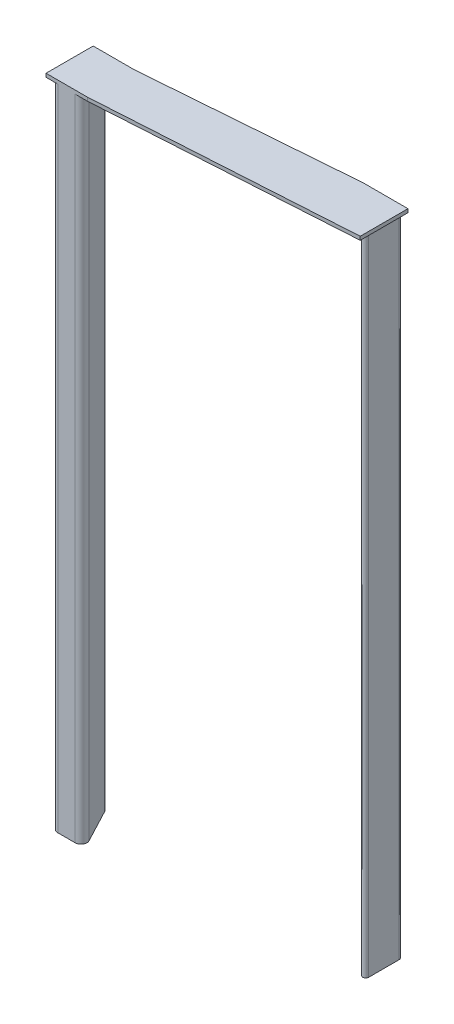
ISO-10303-21;
HEADER;
FILE_DESCRIPTION(('STEP AP214'),'2;1');
FILE_NAME('part.step','',(''),(''),'','','');
FILE_SCHEMA(('AUTOMOTIVE_DESIGN { 1 0 10303 214 1 1 1 1 }'));
ENDSEC;
DATA;
#1=APPLICATION_CONTEXT('core data for automotive mechanical design processes');
#2=APPLICATION_PROTOCOL_DEFINITION('international standard','automotive_design',2000,#1);
#3=PRODUCT_CONTEXT('',#1,'mechanical');
#4=PRODUCT('Part','Part','',(#3));
#5=PRODUCT_RELATED_PRODUCT_CATEGORY('part','',(#4));
#6=PRODUCT_DEFINITION_FORMATION('','',#4);
#7=PRODUCT_DEFINITION_CONTEXT('part definition',#1,'design');
#8=PRODUCT_DEFINITION('design','',#6,#7);
#9=PRODUCT_DEFINITION_SHAPE('','',#8);
#10=(LENGTH_UNIT() NAMED_UNIT(*) SI_UNIT(.MILLI.,.METRE.));
#11=(NAMED_UNIT(*) PLANE_ANGLE_UNIT() SI_UNIT($,.RADIAN.));
#12=(NAMED_UNIT(*) SI_UNIT($,.STERADIAN.) SOLID_ANGLE_UNIT());
#13=UNCERTAINTY_MEASURE_WITH_UNIT(LENGTH_MEASURE(1.E-05),#10,'distance_accuracy_value','');
#14=(GEOMETRIC_REPRESENTATION_CONTEXT(3) GLOBAL_UNCERTAINTY_ASSIGNED_CONTEXT((#13)) GLOBAL_UNIT_ASSIGNED_CONTEXT((#10,
#11,#12)) REPRESENTATION_CONTEXT('',''));
#15=CARTESIAN_POINT('',(0.,0.,0.));
#16=DIRECTION('',(0.,0.,1.));
#17=DIRECTION('',(1.,0.,0.));
#18=AXIS2_PLACEMENT_3D('',#15,#16,#17);
#19=CARTESIAN_POINT('',(97.2,238.085353189805,-7.4));
#20=DIRECTION('',(-0.785165755458099,0.,0.61928566627681));
#21=DIRECTION('',(0.61928566627681,0.,0.785165755458099));
#22=AXIS2_PLACEMENT_3D('',#19,#20,#21);
#23=PLANE('',#22);
#24=DIRECTION('',(-0.61928566627681,0.,-0.785165755458099));
#25=VECTOR('',#24,1.);
#26=CARTESIAN_POINT('',(97.2,0.,-7.4));
#27=LINE('',#26,#25);
#28=CARTESIAN_POINT('',(95.4148342445419,0.,-9.66333515424152));
#29=VERTEX_POINT('',#28);
#30=CARTESIAN_POINT('',(87.2771830607254,0.,-19.9807143337232));
#31=VERTEX_POINT('',#30);
#32=EDGE_CURVE('E158',#29,#31,#27,.T.);
#33=ORIENTED_EDGE('',*,*,#32,.F.);
#34=DIRECTION('',(0.,-1.,0.));
#35=VECTOR('',#34,1.);
#36=CARTESIAN_POINT('',(95.4148342445419,238.085353189805,-9.66333515424152));
#37=LINE('',#36,#35);
#38=CARTESIAN_POINT('',(95.4148342445419,220.,-9.66333515424152));
#39=VERTEX_POINT('',#38);
#40=EDGE_CURVE('E143',#29,#39,#37,.F.);
#41=ORIENTED_EDGE('',*,*,#40,.T.);
#42=DIRECTION('',(0.61928566627681,0.,0.785165755458099));
#43=VECTOR('',#42,1.);
#44=CARTESIAN_POINT('',(97.2,220.,-7.4));
#45=LINE('',#44,#43);
#46=CARTESIAN_POINT('',(87.2771830607254,220.,-19.9807143337232));
#47=VERTEX_POINT('',#46);
#48=EDGE_CURVE('E113',#47,#39,#45,.T.);
#49=ORIENTED_EDGE('',*,*,#48,.F.);
#50=DIRECTION('',(0.,-1.,0.));
#51=VECTOR('',#50,1.);
#52=CARTESIAN_POINT('',(87.2771830607254,238.085353189805,-19.9807143337232));
#53=LINE('',#52,#51);
#54=EDGE_CURVE('E140',#47,#31,#53,.T.);
#55=ORIENTED_EDGE('',*,*,#54,.T.);
#56=EDGE_LOOP('',(#33,#41,#49,#55));
#57=FACE_BOUND('',#56,.T.);
#58=ADVANCED_FACE('F55',(#57),#23,.T.);
#59=CARTESIAN_POINT('',(97.2,238.085353189805,-21.6));
#60=DIRECTION('',(1.,0.,0.));
#61=DIRECTION('',(0.,0.,-1.));
#62=AXIS2_PLACEMENT_3D('',#59,#60,#61);
#63=PLANE('',#62);
#64=DIRECTION('',(0.,0.,-1.));
#65=VECTOR('',#64,1.);
#66=CARTESIAN_POINT('',(97.2,220.,-21.6));
#67=LINE('',#66,#65);
#68=CARTESIAN_POINT('',(97.2,220.,-10.2826208205183));
#69=VERTEX_POINT('',#68);
#70=CARTESIAN_POINT('',(97.2,220.,-20.6));
#71=VERTEX_POINT('',#70);
#72=EDGE_CURVE('E111',#69,#71,#67,.T.);
#73=ORIENTED_EDGE('',*,*,#72,.F.);
#74=DIRECTION('',(0.,-1.,0.));
#75=VECTOR('',#74,1.);
#76=CARTESIAN_POINT('',(97.2,238.085353189805,-10.2826208205183));
#77=LINE('',#76,#75);
#78=CARTESIAN_POINT('',(97.2,0.,-10.2826208205183));
#79=VERTEX_POINT('',#78);
#80=EDGE_CURVE('E122',#69,#79,#77,.T.);
#81=ORIENTED_EDGE('',*,*,#80,.T.);
#82=DIRECTION('',(0.,0.,1.));
#83=VECTOR('',#82,1.);
#84=CARTESIAN_POINT('',(97.2,0.,-21.6));
#85=LINE('',#84,#83);
#86=CARTESIAN_POINT('',(97.2,0.,-20.6));
#87=VERTEX_POINT('',#86);
#88=EDGE_CURVE('E126',#87,#79,#85,.T.);
#89=ORIENTED_EDGE('',*,*,#88,.F.);
#90=DIRECTION('',(0.,-1.,0.));
#91=VECTOR('',#90,1.);
#92=CARTESIAN_POINT('',(97.2,238.085353189805,-20.6));
#93=LINE('',#92,#91);
#94=EDGE_CURVE('E125',#87,#71,#93,.F.);
#95=ORIENTED_EDGE('',*,*,#94,.T.);
#96=EDGE_LOOP('',(#73,#81,#89,#95));
#97=FACE_BOUND('',#96,.T.);
#98=ADVANCED_FACE('F120',(#97),#63,.T.);
#99=CARTESIAN_POINT('',(86.,238.085353189805,-21.6));
#100=DIRECTION('',(0.,0.,-1.));
#101=DIRECTION('',(-1.,0.,0.));
#102=AXIS2_PLACEMENT_3D('',#99,#100,#101);
#103=PLANE('',#102);
#104=DIRECTION('',(-1.,0.,0.));
#105=VECTOR('',#104,1.);
#106=CARTESIAN_POINT('',(86.,220.,-21.6));
#107=LINE('',#106,#105);
#108=CARTESIAN_POINT('',(96.2,220.,-21.6));
#109=VERTEX_POINT('',#108);
#110=CARTESIAN_POINT('',(88.0623488161835,220.,-21.6));
#111=VERTEX_POINT('',#110);
#112=EDGE_CURVE('E134',#109,#111,#107,.T.);
#113=ORIENTED_EDGE('',*,*,#112,.F.);
#114=DIRECTION('',(0.,-1.,0.));
#115=VECTOR('',#114,1.);
#116=CARTESIAN_POINT('',(96.2,238.085353189805,-21.6));
#117=LINE('',#116,#115);
#118=CARTESIAN_POINT('',(96.2,0.,-21.6));
#119=VERTEX_POINT('',#118);
#120=EDGE_CURVE('E12',#109,#119,#117,.T.);
#121=ORIENTED_EDGE('',*,*,#120,.T.);
#122=DIRECTION('',(1.,0.,0.));
#123=VECTOR('',#122,1.);
#124=CARTESIAN_POINT('',(86.,0.,-21.6));
#125=LINE('',#124,#123);
#126=CARTESIAN_POINT('',(88.0623488161835,0.,-21.6));
#127=VERTEX_POINT('',#126);
#128=EDGE_CURVE('E157',#127,#119,#125,.T.);
#129=ORIENTED_EDGE('',*,*,#128,.F.);
#130=DIRECTION('',(0.,-1.,0.));
#131=VECTOR('',#130,1.);
#132=CARTESIAN_POINT('',(88.0623488161835,238.085353189805,-21.6));
#133=LINE('',#132,#131);
#134=EDGE_CURVE('E63',#127,#111,#133,.F.);
#135=ORIENTED_EDGE('',*,*,#134,.T.);
#136=EDGE_LOOP('',(#113,#121,#129,#135));
#137=FACE_BOUND('',#136,.T.);
#138=ADVANCED_FACE('F159',(#137),#103,.T.);
#139=CARTESIAN_POINT('',(0.,0.,0.));
#140=DIRECTION('',(0.,-1.,0.));
#141=DIRECTION('',(0.,0.,-1.));
#142=AXIS2_PLACEMENT_3D('',#139,#140,#141);
#143=PLANE('',#142);
#144=CARTESIAN_POINT('',(93.6,0.,-18.));
#145=DIRECTION('',(0.,-1.,0.));
#146=DIRECTION('',(0.,0.,-1.));
#147=AXIS2_PLACEMENT_3D('',#144,#145,#146);
#148=CIRCLE('',#147,2.);
#149=CARTESIAN_POINT('',(93.6,0.,-20.));
#150=VERTEX_POINT('',#149);
#151=EDGE_CURVE('E163',#150,#150,#148,.T.);
#152=ORIENTED_EDGE('',*,*,#151,.F.);
#153=EDGE_LOOP('',(#152));
#154=FACE_BOUND('',#153,.T.);
#155=ORIENTED_EDGE('',*,*,#88,.T.);
#156=CARTESIAN_POINT('',(96.2,0.,-10.2826208205183));
#157=DIRECTION('',(0.,-1.,0.));
#158=DIRECTION('',(0.,0.,-1.));
#159=AXIS2_PLACEMENT_3D('',#156,#157,#158);
#160=CIRCLE('',#159,1.);
#161=EDGE_CURVE('E129',#79,#29,#160,.T.);
#162=ORIENTED_EDGE('',*,*,#161,.T.);
#163=ORIENTED_EDGE('',*,*,#32,.T.);
#164=CARTESIAN_POINT('',(88.0623488161835,0.,-20.6));
#165=DIRECTION('',(0.,-1.,0.));
#166=DIRECTION('',(0.,0.,-1.));
#167=AXIS2_PLACEMENT_3D('',#164,#165,#166);
#168=CIRCLE('',#167,1.);
#169=EDGE_CURVE('E130',#31,#127,#168,.T.);
#170=ORIENTED_EDGE('',*,*,#169,.T.);
#171=ORIENTED_EDGE('',*,*,#128,.T.);
#172=CARTESIAN_POINT('',(96.2,0.,-20.6));
#173=DIRECTION('',(0.,-1.,0.));
#174=DIRECTION('',(0.,0.,-1.));
#175=AXIS2_PLACEMENT_3D('',#172,#173,#174);
#176=CIRCLE('',#175,1.);
#177=EDGE_CURVE('E132',#119,#87,#176,.T.);
#178=ORIENTED_EDGE('',*,*,#177,.T.);
#179=EDGE_LOOP('',(#155,#162,#163,#170,#171,#178));
#180=FACE_BOUND('',#179,.T.);
#181=ADVANCED_FACE('F156',(#154,#180),#143,.T.);
#182=CARTESIAN_POINT('',(0.,220.,0.));
#183=DIRECTION('',(0.,-1.,0.));
#184=DIRECTION('',(0.,0.,-1.));
#185=AXIS2_PLACEMENT_3D('',#182,#183,#184);
#186=PLANE('',#185);
#187=ORIENTED_EDGE('',*,*,#48,.T.);
#188=CARTESIAN_POINT('',(96.2,220.,-10.2826208205183));
#189=DIRECTION('',(0.,-1.,0.));
#190=DIRECTION('',(0.,0.,-1.));
#191=AXIS2_PLACEMENT_3D('',#188,#189,#190);
#192=CIRCLE('',#191,1.);
#193=EDGE_CURVE('E108',#39,#69,#192,.F.);
#194=ORIENTED_EDGE('',*,*,#193,.T.);
#195=ORIENTED_EDGE('',*,*,#72,.T.);
#196=CARTESIAN_POINT('',(96.2,220.,-20.6));
#197=DIRECTION('',(0.,-1.,0.));
#198=DIRECTION('',(0.,0.,-1.));
#199=AXIS2_PLACEMENT_3D('',#196,#197,#198);
#200=CIRCLE('',#199,1.);
#201=EDGE_CURVE('E76',#71,#109,#200,.F.);
#202=ORIENTED_EDGE('',*,*,#201,.T.);
#203=ORIENTED_EDGE('',*,*,#112,.T.);
#204=CARTESIAN_POINT('',(88.0623488161835,220.,-20.6));
#205=DIRECTION('',(0.,-1.,0.));
#206=DIRECTION('',(0.,0.,-1.));
#207=AXIS2_PLACEMENT_3D('',#204,#205,#206);
#208=CIRCLE('',#207,1.);
#209=EDGE_CURVE('E145',#111,#47,#208,.F.);
#210=ORIENTED_EDGE('',*,*,#209,.T.);
#211=EDGE_LOOP('',(#187,#194,#195,#202,#203,#210));
#212=FACE_BOUND('',#211,.T.);
#213=ADVANCED_FACE('F110',(#212),#186,.F.);
#214=CARTESIAN_POINT('',(93.6,5.,-18.));
#215=DIRECTION('',(0.,-1.,0.));
#216=DIRECTION('',(0.,0.,-1.));
#217=AXIS2_PLACEMENT_3D('',#214,#215,#216);
#218=CYLINDRICAL_SURFACE('',#217,2.);
#219=CARTESIAN_POINT('',(93.6,5.,-18.));
#220=DIRECTION('',(0.,-1.,0.));
#221=DIRECTION('',(0.,0.,-1.));
#222=AXIS2_PLACEMENT_3D('',#219,#220,#221);
#223=CIRCLE('',#222,2.);
#224=CARTESIAN_POINT('',(93.6,5.,-20.));
#225=VERTEX_POINT('',#224);
#226=EDGE_CURVE('E166',#225,#225,#223,.T.);
#227=ORIENTED_EDGE('',*,*,#226,.F.);
#228=EDGE_LOOP('',(#227));
#229=FACE_BOUND('',#228,.T.);
#230=ORIENTED_EDGE('',*,*,#151,.T.);
#231=EDGE_LOOP('',(#230));
#232=FACE_BOUND('',#231,.T.);
#233=ADVANCED_FACE('F172',(#229,#232),#218,.F.);
#234=CARTESIAN_POINT('',(93.6,5.,-18.));
#235=DIRECTION('',(0.,-1.,0.));
#236=DIRECTION('',(0.,0.,-1.));
#237=AXIS2_PLACEMENT_3D('',#234,#235,#236);
#238=PLANE('',#237);
#239=ORIENTED_EDGE('',*,*,#226,.T.);
#240=EDGE_LOOP('',(#239));
#241=FACE_BOUND('',#240,.T.);
#242=ADVANCED_FACE('F192',(#241),#238,.T.);
#243=CARTESIAN_POINT('',(96.2,238.085353189805,-10.2826208205183));
#244=DIRECTION('',(0.,-1.,0.));
#245=DIRECTION('',(0.,0.,-1.));
#246=AXIS2_PLACEMENT_3D('',#243,#244,#245);
#247=CYLINDRICAL_SURFACE('',#246,1.);
#248=ORIENTED_EDGE('',*,*,#193,.F.);
#249=ORIENTED_EDGE('',*,*,#40,.F.);
#250=ORIENTED_EDGE('',*,*,#161,.F.);
#251=ORIENTED_EDGE('',*,*,#80,.F.);
#252=EDGE_LOOP('',(#248,#249,#250,#251));
#253=FACE_BOUND('',#252,.T.);
#254=ADVANCED_FACE('F128',(#253),#247,.T.);
#255=CARTESIAN_POINT('',(96.2,238.085353189805,-20.6));
#256=DIRECTION('',(0.,-1.,0.));
#257=DIRECTION('',(0.,0.,-1.));
#258=AXIS2_PLACEMENT_3D('',#255,#256,#257);
#259=CYLINDRICAL_SURFACE('',#258,1.);
#260=ORIENTED_EDGE('',*,*,#201,.F.);
#261=ORIENTED_EDGE('',*,*,#94,.F.);
#262=ORIENTED_EDGE('',*,*,#177,.F.);
#263=ORIENTED_EDGE('',*,*,#120,.F.);
#264=EDGE_LOOP('',(#260,#261,#262,#263));
#265=FACE_BOUND('',#264,.T.);
#266=ADVANCED_FACE('F191',(#265),#259,.T.);
#267=CARTESIAN_POINT('',(88.0623488161835,238.085353189805,-20.6));
#268=DIRECTION('',(0.,-1.,0.));
#269=DIRECTION('',(0.,0.,-1.));
#270=AXIS2_PLACEMENT_3D('',#267,#268,#269);
#271=CYLINDRICAL_SURFACE('',#270,1.);
#272=ORIENTED_EDGE('',*,*,#209,.F.);
#273=ORIENTED_EDGE('',*,*,#134,.F.);
#274=ORIENTED_EDGE('',*,*,#169,.F.);
#275=ORIENTED_EDGE('',*,*,#54,.F.);
#276=EDGE_LOOP('',(#272,#273,#274,#275));
#277=FACE_BOUND('',#276,.T.);
#278=ADVANCED_FACE('F57',(#277),#271,.T.);
#279=CLOSED_SHELL('',(#58,#98,#138,#181,#213,#233,#242,#254,#266,#278));
#280=MANIFOLD_SOLID_BREP('B2',#279);
#281=CARTESIAN_POINT('',(11.2,220.,0.));
#282=DIRECTION('',(0.,0.,-1.));
#283=DIRECTION('',(-1.,0.,0.));
#284=AXIS2_PLACEMENT_3D('',#281,#282,#283);
#285=PLANE('',#284);
#286=DIRECTION('',(1.,0.,0.));
#287=VECTOR('',#286,1.);
#288=CARTESIAN_POINT('',(11.2,0.,0.));
#289=LINE('',#288,#287);
#290=CARTESIAN_POINT('',(2.,0.,0.));
#291=VERTEX_POINT('',#290);
#292=CARTESIAN_POINT('',(7.881447611978,0.,0.));
#293=VERTEX_POINT('',#292);
#294=EDGE_CURVE('E461',#291,#293,#289,.T.);
#295=ORIENTED_EDGE('',*,*,#294,.T.);
#296=DIRECTION('',(0.,-1.,0.));
#297=VECTOR('',#296,1.);
#298=CARTESIAN_POINT('',(7.881447611978,220.,0.));
#299=LINE('',#298,#297);
#300=CARTESIAN_POINT('',(7.881447611978,220.,0.));
#301=VERTEX_POINT('',#300);
#302=EDGE_CURVE('E53',#293,#301,#299,.F.);
#303=ORIENTED_EDGE('',*,*,#302,.T.);
#304=DIRECTION('',(1.,0.,0.));
#305=VECTOR('',#304,1.);
#306=CARTESIAN_POINT('',(12.,220.,0.));
#307=LINE('',#306,#305);
#308=CARTESIAN_POINT('',(12.,220.,0.));
#309=VERTEX_POINT('',#308);
#310=EDGE_CURVE('E541',#301,#309,#307,.T.);
#311=ORIENTED_EDGE('',*,*,#310,.T.);
#312=DIRECTION('',(0.,-1.,0.));
#313=VECTOR('',#312,1.);
#314=CARTESIAN_POINT('',(12.,221.2,0.));
#315=LINE('',#314,#313);
#316=CARTESIAN_POINT('',(12.,221.2,0.));
#317=VERTEX_POINT('',#316);
#318=EDGE_CURVE('E558',#317,#309,#315,.T.);
#319=ORIENTED_EDGE('',*,*,#318,.F.);
#320=DIRECTION('',(1.,0.,0.));
#321=VECTOR('',#320,1.);
#322=CARTESIAN_POINT('',(12.,221.2,0.));
#323=LINE('',#322,#321);
#324=CARTESIAN_POINT('',(-2.,221.2,0.));
#325=VERTEX_POINT('',#324);
#326=EDGE_CURVE('E591',#325,#317,#323,.T.);
#327=ORIENTED_EDGE('',*,*,#326,.F.);
#328=DIRECTION('',(0.,-1.,0.));
#329=VECTOR('',#328,1.);
#330=CARTESIAN_POINT('',(-2.,221.2,0.));
#331=LINE('',#330,#329);
#332=CARTESIAN_POINT('',(-2.,220.,0.));
#333=VERTEX_POINT('',#332);
#334=EDGE_CURVE('E561',#325,#333,#331,.T.);
#335=ORIENTED_EDGE('',*,*,#334,.T.);
#336=CARTESIAN_POINT('',(2.,220.,0.));
#337=VERTEX_POINT('',#336);
#338=EDGE_CURVE('E523',#333,#337,#307,.T.);
#339=ORIENTED_EDGE('',*,*,#338,.T.);
#340=DIRECTION('',(0.,-1.,0.));
#341=VECTOR('',#340,1.);
#342=CARTESIAN_POINT('',(2.,220.,0.));
#343=LINE('',#342,#341);
#344=EDGE_CURVE('E270',#337,#291,#343,.T.);
#345=ORIENTED_EDGE('',*,*,#344,.T.);
#346=EDGE_LOOP('',(#295,#303,#311,#319,#327,#335,#339,#345));
#347=FACE_BOUND('',#346,.T.);
#348=ADVANCED_FACE('F261',(#347),#285,.F.);
#349=CARTESIAN_POINT('',(0.,220.,-21.2));
#350=DIRECTION('',(-0.884193384073724,0.,0.467121033095552));
#351=DIRECTION('',(0.467121033095552,0.,0.884193384073724));
#352=AXIS2_PLACEMENT_3D('',#349,#350,#351);
#353=PLANE('',#352);
#354=DIRECTION('',(-0.467121033095552,0.,-0.884193384073724));
#355=VECTOR('',#354,1.);
#356=CARTESIAN_POINT('',(0.,0.,-21.2));
#357=LINE('',#356,#355);
#358=CARTESIAN_POINT('',(9.64983438012545,0.,-2.93424206619111));
#359=VERTEX_POINT('',#358);
#360=CARTESIAN_POINT('',(3.76838676814745,0.,-14.0669821888638));
#361=VERTEX_POINT('',#360);
#362=EDGE_CURVE('E477',#359,#361,#357,.T.);
#363=ORIENTED_EDGE('',*,*,#362,.T.);
#364=DIRECTION('',(0.,-1.,0.));
#365=VECTOR('',#364,1.);
#366=CARTESIAN_POINT('',(3.76838676814745,220.,-14.0669821888638));
#367=LINE('',#366,#365);
#368=CARTESIAN_POINT('',(3.76838676814745,220.,-14.0669821888638));
#369=VERTEX_POINT('',#368);
#370=EDGE_CURVE('E503',#361,#369,#367,.F.);
#371=ORIENTED_EDGE('',*,*,#370,.T.);
#372=DIRECTION('',(-0.467121033095552,0.,-0.884193384073724));
#373=VECTOR('',#372,1.);
#374=CARTESIAN_POINT('',(0.,220.,-21.2));
#375=LINE('',#374,#373);
#376=CARTESIAN_POINT('',(9.64983438012545,220.,-2.93424206619111));
#377=VERTEX_POINT('',#376);
#378=EDGE_CURVE('E465',#377,#369,#375,.T.);
#379=ORIENTED_EDGE('',*,*,#378,.F.);
#380=DIRECTION('',(0.,-1.,0.));
#381=VECTOR('',#380,1.);
#382=CARTESIAN_POINT('',(9.64983438012545,220.,-2.93424206619111));
#383=LINE('',#382,#381);
#384=EDGE_CURVE('E499',#377,#359,#383,.T.);
#385=ORIENTED_EDGE('',*,*,#384,.T.);
#386=EDGE_LOOP('',(#363,#371,#379,#385));
#387=FACE_BOUND('',#386,.T.);
#388=ADVANCED_FACE('F534',(#387),#353,.F.);
#389=CARTESIAN_POINT('',(0.,220.,0.));
#390=DIRECTION('',(1.,0.,0.));
#391=DIRECTION('',(0.,0.,-1.));
#392=AXIS2_PLACEMENT_3D('',#389,#390,#391);
#393=PLANE('',#392);
#394=DIRECTION('',(0.,0.,1.));
#395=VECTOR('',#394,1.);
#396=CARTESIAN_POINT('',(0.,220.,0.));
#397=LINE('',#396,#395);
#398=CARTESIAN_POINT('',(0.,220.,-13.1327401226727));
#399=VERTEX_POINT('',#398);
#400=CARTESIAN_POINT('',(0.,220.,-2.));
#401=VERTEX_POINT('',#400);
#402=EDGE_CURVE('E469',#399,#401,#397,.T.);
#403=ORIENTED_EDGE('',*,*,#402,.F.);
#404=DIRECTION('',(0.,-1.,0.));
#405=VECTOR('',#404,1.);
#406=CARTESIAN_POINT('',(0.,220.,-13.1327401226727));
#407=LINE('',#406,#405);
#408=CARTESIAN_POINT('',(0.,0.,-13.1327401226727));
#409=VERTEX_POINT('',#408);
#410=EDGE_CURVE('E486',#399,#409,#407,.T.);
#411=ORIENTED_EDGE('',*,*,#410,.T.);
#412=DIRECTION('',(0.,0.,1.));
#413=VECTOR('',#412,1.);
#414=CARTESIAN_POINT('',(0.,0.,0.));
#415=LINE('',#414,#413);
#416=CARTESIAN_POINT('',(0.,0.,-2.));
#417=VERTEX_POINT('',#416);
#418=EDGE_CURVE('E470',#409,#417,#415,.T.);
#419=ORIENTED_EDGE('',*,*,#418,.T.);
#420=DIRECTION('',(0.,-1.,0.));
#421=VECTOR('',#420,1.);
#422=CARTESIAN_POINT('',(0.,220.,-2.));
#423=LINE('',#422,#421);
#424=EDGE_CURVE('E474',#417,#401,#423,.F.);
#425=ORIENTED_EDGE('',*,*,#424,.T.);
#426=EDGE_LOOP('',(#403,#411,#419,#425));
#427=FACE_BOUND('',#426,.T.);
#428=ADVANCED_FACE('F616',(#427),#393,.F.);
#429=CARTESIAN_POINT('',(0.,0.,0.));
#430=DIRECTION('',(0.,-1.,0.));
#431=DIRECTION('',(0.,0.,-1.));
#432=AXIS2_PLACEMENT_3D('',#429,#430,#431);
#433=PLANE('',#432);
#434=DIRECTION('',(0.,0.,-1.));
#435=VECTOR('',#434,1.);
#436=CARTESIAN_POINT('',(2.,0.,-7.2));
#437=LINE('',#436,#435);
#438=CARTESIAN_POINT('',(2.,0.,-7.2));
#439=VERTEX_POINT('',#438);
#440=CARTESIAN_POINT('',(2.,0.,-9.6));
#441=VERTEX_POINT('',#440);
#442=EDGE_CURVE('E277',#439,#441,#437,.T.);
#443=ORIENTED_EDGE('',*,*,#442,.F.);
#444=DIRECTION('',(-1.,0.,0.));
#445=VECTOR('',#444,1.);
#446=CARTESIAN_POINT('',(2.,0.,-7.2));
#447=LINE('',#446,#445);
#448=CARTESIAN_POINT('',(4.4,0.,-7.2));
#449=VERTEX_POINT('',#448);
#450=EDGE_CURVE('E422',#449,#439,#447,.T.);
#451=ORIENTED_EDGE('',*,*,#450,.F.);
#452=DIRECTION('',(0.,0.,1.));
#453=VECTOR('',#452,1.);
#454=CARTESIAN_POINT('',(4.4,0.,-7.2));
#455=LINE('',#454,#453);
#456=CARTESIAN_POINT('',(4.4,0.,-9.6));
#457=VERTEX_POINT('',#456);
#458=EDGE_CURVE('E438',#457,#449,#455,.T.);
#459=ORIENTED_EDGE('',*,*,#458,.F.);
#460=DIRECTION('',(1.,0.,0.));
#461=VECTOR('',#460,1.);
#462=CARTESIAN_POINT('',(2.,0.,-9.6));
#463=LINE('',#462,#461);
#464=EDGE_CURVE('E411',#441,#457,#463,.T.);
#465=ORIENTED_EDGE('',*,*,#464,.F.);
#466=EDGE_LOOP('',(#443,#451,#459,#465));
#467=FACE_BOUND('',#466,.T.);
#468=CARTESIAN_POINT('',(4.,0.,-4.));
#469=DIRECTION('',(0.,-1.,0.));
#470=DIRECTION('',(0.,0.,-1.));
#471=AXIS2_PLACEMENT_3D('',#468,#469,#470);
#472=CIRCLE('',#471,2.);
#473=CARTESIAN_POINT('',(4.,0.,-6.));
#474=VERTEX_POINT('',#473);
#475=EDGE_CURVE('E448',#474,#474,#472,.T.);
#476=ORIENTED_EDGE('',*,*,#475,.F.);
#477=EDGE_LOOP('',(#476));
#478=FACE_BOUND('',#477,.T.);
#479=ORIENTED_EDGE('',*,*,#418,.F.);
#480=CARTESIAN_POINT('',(2.,0.,-13.1327401226727));
#481=DIRECTION('',(0.,-1.,0.));
#482=DIRECTION('',(0.,0.,-1.));
#483=AXIS2_PLACEMENT_3D('',#480,#481,#482);
#484=CIRCLE('',#483,2.);
#485=EDGE_CURVE('E496',#409,#361,#484,.T.);
#486=ORIENTED_EDGE('',*,*,#485,.T.);
#487=ORIENTED_EDGE('',*,*,#362,.F.);
#488=CARTESIAN_POINT('',(7.881447611978,0.,-2.));
#489=DIRECTION('',(0.,-1.,0.));
#490=DIRECTION('',(0.,0.,-1.));
#491=AXIS2_PLACEMENT_3D('',#488,#489,#490);
#492=CIRCLE('',#491,2.);
#493=EDGE_CURVE('E493',#359,#293,#492,.T.);
#494=ORIENTED_EDGE('',*,*,#493,.T.);
#495=ORIENTED_EDGE('',*,*,#294,.F.);
#496=CARTESIAN_POINT('',(2.,0.,-2.));
#497=DIRECTION('',(0.,-1.,0.));
#498=DIRECTION('',(0.,0.,-1.));
#499=AXIS2_PLACEMENT_3D('',#496,#497,#498);
#500=CIRCLE('',#499,2.);
#501=EDGE_CURVE('E490',#291,#417,#500,.T.);
#502=ORIENTED_EDGE('',*,*,#501,.T.);
#503=EDGE_LOOP('',(#479,#486,#487,#494,#495,#502));
#504=FACE_BOUND('',#503,.T.);
#505=ADVANCED_FACE('F528',(#467,#478,#504),#433,.T.);
#506=CARTESIAN_POINT('',(2.,220.,-13.1327401226727));
#507=DIRECTION('',(0.,-1.,0.));
#508=DIRECTION('',(0.,0.,-1.));
#509=AXIS2_PLACEMENT_3D('',#506,#507,#508);
#510=CYLINDRICAL_SURFACE('',#509,2.);
#511=CARTESIAN_POINT('',(2.,220.,-13.1327401226727));
#512=DIRECTION('',(0.,-1.,0.));
#513=DIRECTION('',(0.,0.,-1.));
#514=AXIS2_PLACEMENT_3D('',#511,#512,#513);
#515=CIRCLE('',#514,2.);
#516=EDGE_CURVE('E514',#369,#399,#515,.F.);
#517=ORIENTED_EDGE('',*,*,#516,.F.);
#518=ORIENTED_EDGE('',*,*,#370,.F.);
#519=ORIENTED_EDGE('',*,*,#485,.F.);
#520=ORIENTED_EDGE('',*,*,#410,.F.);
#521=EDGE_LOOP('',(#517,#518,#519,#520));
#522=FACE_BOUND('',#521,.T.);
#523=ADVANCED_FACE('F620',(#522),#510,.T.);
#524=CARTESIAN_POINT('',(7.881447611978,220.,-2.));
#525=DIRECTION('',(0.,-1.,0.));
#526=DIRECTION('',(0.,0.,-1.));
#527=AXIS2_PLACEMENT_3D('',#524,#525,#526);
#528=CYLINDRICAL_SURFACE('',#527,2.);
#529=CARTESIAN_POINT('',(7.881447611978,220.,-2.));
#530=DIRECTION('',(0.,-1.,0.));
#531=DIRECTION('',(0.,0.,-1.));
#532=AXIS2_PLACEMENT_3D('',#529,#530,#531);
#533=CIRCLE('',#532,2.);
#534=EDGE_CURVE('E510',#301,#377,#533,.F.);
#535=ORIENTED_EDGE('',*,*,#534,.F.);
#536=ORIENTED_EDGE('',*,*,#302,.F.);
#537=ORIENTED_EDGE('',*,*,#493,.F.);
#538=ORIENTED_EDGE('',*,*,#384,.F.);
#539=EDGE_LOOP('',(#535,#536,#537,#538));
#540=FACE_BOUND('',#539,.T.);
#541=ADVANCED_FACE('F531',(#540),#528,.T.);
#542=CARTESIAN_POINT('',(2.,220.,-2.));
#543=DIRECTION('',(0.,-1.,0.));
#544=DIRECTION('',(0.,0.,-1.));
#545=AXIS2_PLACEMENT_3D('',#542,#543,#544);
#546=CYLINDRICAL_SURFACE('',#545,2.);
#547=CARTESIAN_POINT('',(2.,220.,-2.));
#548=DIRECTION('',(0.,-1.,0.));
#549=DIRECTION('',(0.,0.,-1.));
#550=AXIS2_PLACEMENT_3D('',#547,#548,#549);
#551=CIRCLE('',#550,2.);
#552=EDGE_CURVE('E506',#401,#337,#551,.F.);
#553=ORIENTED_EDGE('',*,*,#552,.F.);
#554=ORIENTED_EDGE('',*,*,#424,.F.);
#555=ORIENTED_EDGE('',*,*,#501,.F.);
#556=ORIENTED_EDGE('',*,*,#344,.F.);
#557=EDGE_LOOP('',(#553,#554,#555,#556));
#558=FACE_BOUND('',#557,.T.);
#559=ADVANCED_FACE('F263',(#558),#546,.T.);
#560=CARTESIAN_POINT('',(4.,5.,-4.));
#561=DIRECTION('',(0.,-1.,0.));
#562=DIRECTION('',(0.,0.,-1.));
#563=AXIS2_PLACEMENT_3D('',#560,#561,#562);
#564=CYLINDRICAL_SURFACE('',#563,2.);
#565=CARTESIAN_POINT('',(4.,5.,-4.));
#566=DIRECTION('',(0.,-1.,0.));
#567=DIRECTION('',(0.,0.,-1.));
#568=AXIS2_PLACEMENT_3D('',#565,#566,#567);
#569=CIRCLE('',#568,2.);
#570=CARTESIAN_POINT('',(4.,5.,-6.));
#571=VERTEX_POINT('',#570);
#572=EDGE_CURVE('E457',#571,#571,#569,.T.);
#573=ORIENTED_EDGE('',*,*,#572,.F.);
#574=EDGE_LOOP('',(#573));
#575=FACE_BOUND('',#574,.T.);
#576=ORIENTED_EDGE('',*,*,#475,.T.);
#577=EDGE_LOOP('',(#576));
#578=FACE_BOUND('',#577,.T.);
#579=ADVANCED_FACE('F627',(#575,#578),#564,.F.);
#580=CARTESIAN_POINT('',(4.,5.,-4.));
#581=DIRECTION('',(0.,-1.,0.));
#582=DIRECTION('',(0.,0.,-1.));
#583=AXIS2_PLACEMENT_3D('',#580,#581,#582);
#584=PLANE('',#583);
#585=ORIENTED_EDGE('',*,*,#572,.T.);
#586=EDGE_LOOP('',(#585));
#587=FACE_BOUND('',#586,.T.);
#588=ADVANCED_FACE('F632',(#587),#584,.T.);
#589=CARTESIAN_POINT('',(2.,2.,-7.2));
#590=DIRECTION('',(-1.,0.,0.));
#591=DIRECTION('',(0.,0.,1.));
#592=AXIS2_PLACEMENT_3D('',#589,#590,#591);
#593=PLANE('',#592);
#594=ORIENTED_EDGE('',*,*,#442,.T.);
#595=DIRECTION('',(0.,-1.,0.));
#596=VECTOR('',#595,1.);
#597=CARTESIAN_POINT('',(2.,2.,-9.6));
#598=LINE('',#597,#596);
#599=CARTESIAN_POINT('',(2.,2.,-9.6));
#600=VERTEX_POINT('',#599);
#601=EDGE_CURVE('E433',#600,#441,#598,.T.);
#602=ORIENTED_EDGE('',*,*,#601,.F.);
#603=DIRECTION('',(0.,0.,-1.));
#604=VECTOR('',#603,1.);
#605=CARTESIAN_POINT('',(2.,2.,-7.2));
#606=LINE('',#605,#604);
#607=CARTESIAN_POINT('',(2.,2.,-7.2));
#608=VERTEX_POINT('',#607);
#609=EDGE_CURVE('E417',#608,#600,#606,.T.);
#610=ORIENTED_EDGE('',*,*,#609,.F.);
#611=DIRECTION('',(0.,-1.,0.));
#612=VECTOR('',#611,1.);
#613=CARTESIAN_POINT('',(2.,2.,-7.2));
#614=LINE('',#613,#612);
#615=EDGE_CURVE('E445',#608,#439,#614,.T.);
#616=ORIENTED_EDGE('',*,*,#615,.T.);
#617=EDGE_LOOP('',(#594,#602,#610,#616));
#618=FACE_BOUND('',#617,.T.);
#619=ADVANCED_FACE('F647',(#618),#593,.F.);
#620=CARTESIAN_POINT('',(2.,2.,-7.2));
#621=DIRECTION('',(0.,0.,1.));
#622=DIRECTION('',(1.,0.,0.));
#623=AXIS2_PLACEMENT_3D('',#620,#621,#622);
#624=PLANE('',#623);
#625=ORIENTED_EDGE('',*,*,#450,.T.);
#626=ORIENTED_EDGE('',*,*,#615,.F.);
#627=DIRECTION('',(-1.,0.,0.));
#628=VECTOR('',#627,1.);
#629=CARTESIAN_POINT('',(2.,2.,-7.2));
#630=LINE('',#629,#628);
#631=CARTESIAN_POINT('',(4.4,2.,-7.2));
#632=VERTEX_POINT('',#631);
#633=EDGE_CURVE('E430',#632,#608,#630,.T.);
#634=ORIENTED_EDGE('',*,*,#633,.F.);
#635=DIRECTION('',(0.,-1.,0.));
#636=VECTOR('',#635,1.);
#637=CARTESIAN_POINT('',(4.4,2.,-7.2));
#638=LINE('',#637,#636);
#639=EDGE_CURVE('E449',#632,#449,#638,.T.);
#640=ORIENTED_EDGE('',*,*,#639,.T.);
#641=EDGE_LOOP('',(#625,#626,#634,#640));
#642=FACE_BOUND('',#641,.T.);
#643=ADVANCED_FACE('F651',(#642),#624,.F.);
#644=CARTESIAN_POINT('',(4.4,2.,-7.2));
#645=DIRECTION('',(1.,0.,0.));
#646=DIRECTION('',(0.,0.,-1.));
#647=AXIS2_PLACEMENT_3D('',#644,#645,#646);
#648=PLANE('',#647);
#649=ORIENTED_EDGE('',*,*,#458,.T.);
#650=ORIENTED_EDGE('',*,*,#639,.F.);
#651=DIRECTION('',(0.,0.,1.));
#652=VECTOR('',#651,1.);
#653=CARTESIAN_POINT('',(4.4,2.,-7.2));
#654=LINE('',#653,#652);
#655=CARTESIAN_POINT('',(4.4,2.,-9.6));
#656=VERTEX_POINT('',#655);
#657=EDGE_CURVE('E426',#656,#632,#654,.T.);
#658=ORIENTED_EDGE('',*,*,#657,.F.);
#659=DIRECTION('',(0.,-1.,0.));
#660=VECTOR('',#659,1.);
#661=CARTESIAN_POINT('',(4.4,2.,-9.6));
#662=LINE('',#661,#660);
#663=EDGE_CURVE('E452',#656,#457,#662,.T.);
#664=ORIENTED_EDGE('',*,*,#663,.T.);
#665=EDGE_LOOP('',(#649,#650,#658,#664));
#666=FACE_BOUND('',#665,.T.);
#667=ADVANCED_FACE('F656',(#666),#648,.F.);
#668=CARTESIAN_POINT('',(2.,2.,-9.6));
#669=DIRECTION('',(0.,0.,-1.));
#670=DIRECTION('',(-1.,0.,0.));
#671=AXIS2_PLACEMENT_3D('',#668,#669,#670);
#672=PLANE('',#671);
#673=ORIENTED_EDGE('',*,*,#464,.T.);
#674=ORIENTED_EDGE('',*,*,#663,.F.);
#675=DIRECTION('',(1.,0.,0.));
#676=VECTOR('',#675,1.);
#677=CARTESIAN_POINT('',(2.,2.,-9.6));
#678=LINE('',#677,#676);
#679=EDGE_CURVE('E421',#600,#656,#678,.T.);
#680=ORIENTED_EDGE('',*,*,#679,.F.);
#681=ORIENTED_EDGE('',*,*,#601,.T.);
#682=EDGE_LOOP('',(#673,#674,#680,#681));
#683=FACE_BOUND('',#682,.T.);
#684=ADVANCED_FACE('F652',(#683),#672,.F.);
#685=CARTESIAN_POINT('',(0.,2.,0.));
#686=DIRECTION('',(0.,-1.,0.));
#687=DIRECTION('',(0.,0.,-1.));
#688=AXIS2_PLACEMENT_3D('',#685,#686,#687);
#689=PLANE('',#688);
#690=ORIENTED_EDGE('',*,*,#609,.T.);
#691=ORIENTED_EDGE('',*,*,#679,.T.);
#692=ORIENTED_EDGE('',*,*,#657,.T.);
#693=ORIENTED_EDGE('',*,*,#633,.T.);
#694=EDGE_LOOP('',(#690,#691,#692,#693));
#695=FACE_BOUND('',#694,.T.);
#696=ADVANCED_FACE('F655',(#695),#689,.T.);
#697=CARTESIAN_POINT('',(99.2,221.2,-21.6));
#698=DIRECTION('',(-1.,0.,0.));
#699=DIRECTION('',(0.,0.,1.));
#700=AXIS2_PLACEMENT_3D('',#697,#698,#699);
#701=PLANE('',#700);
#702=DIRECTION('',(0.,0.,-1.));
#703=VECTOR('',#702,1.);
#704=CARTESIAN_POINT('',(99.2,220.,-21.6));
#705=LINE('',#704,#703);
#706=CARTESIAN_POINT('',(99.2,220.,-5.4));
#707=VERTEX_POINT('',#706);
#708=CARTESIAN_POINT('',(99.2,220.,-21.6));
#709=VERTEX_POINT('',#708);
#710=EDGE_CURVE('E406',#707,#709,#705,.T.);
#711=ORIENTED_EDGE('',*,*,#710,.T.);
#712=DIRECTION('',(0.,-1.,0.));
#713=VECTOR('',#712,1.);
#714=CARTESIAN_POINT('',(99.2,221.2,-21.6));
#715=LINE('',#714,#713);
#716=CARTESIAN_POINT('',(99.2,221.2,-21.6));
#717=VERTEX_POINT('',#716);
#718=EDGE_CURVE('E384',#717,#709,#715,.T.);
#719=ORIENTED_EDGE('',*,*,#718,.F.);
#720=DIRECTION('',(0.,0.,-1.));
#721=VECTOR('',#720,1.);
#722=CARTESIAN_POINT('',(99.2,221.2,-21.6));
#723=LINE('',#722,#721);
#724=CARTESIAN_POINT('',(99.2,221.2,-5.4));
#725=VERTEX_POINT('',#724);
#726=EDGE_CURVE('E392',#725,#717,#723,.T.);
#727=ORIENTED_EDGE('',*,*,#726,.F.);
#728=DIRECTION('',(0.,-1.,0.));
#729=VECTOR('',#728,1.);
#730=CARTESIAN_POINT('',(99.2,221.2,-5.4));
#731=LINE('',#730,#729);
#732=EDGE_CURVE('E555',#725,#707,#731,.T.);
#733=ORIENTED_EDGE('',*,*,#732,.T.);
#734=EDGE_LOOP('',(#711,#719,#727,#733));
#735=FACE_BOUND('',#734,.T.);
#736=ADVANCED_FACE('F404',(#735),#701,.F.);
#737=CARTESIAN_POINT('',(99.2,221.2,-21.6));
#738=DIRECTION('',(0.,0.,1.));
#739=DIRECTION('',(1.,0.,0.));
#740=AXIS2_PLACEMENT_3D('',#737,#738,#739);
#741=PLANE('',#740);
#742=DIRECTION('',(-1.,0.,0.));
#743=VECTOR('',#742,1.);
#744=CARTESIAN_POINT('',(99.2,220.,-21.6));
#745=LINE('',#744,#743);
#746=CARTESIAN_POINT('',(84.,220.,-21.6));
#747=VERTEX_POINT('',#746);
#748=EDGE_CURVE('E582',#709,#747,#745,.T.);
#749=ORIENTED_EDGE('',*,*,#748,.T.);
#750=DIRECTION('',(0.,-1.,0.));
#751=VECTOR('',#750,1.);
#752=CARTESIAN_POINT('',(84.,221.2,-21.6));
#753=LINE('',#752,#751);
#754=CARTESIAN_POINT('',(84.,221.2,-21.6));
#755=VERTEX_POINT('',#754);
#756=EDGE_CURVE('E387',#755,#747,#753,.T.);
#757=ORIENTED_EDGE('',*,*,#756,.F.);
#758=DIRECTION('',(-1.,0.,0.));
#759=VECTOR('',#758,1.);
#760=CARTESIAN_POINT('',(99.2,221.2,-21.6));
#761=LINE('',#760,#759);
#762=EDGE_CURVE('E380',#717,#755,#761,.T.);
#763=ORIENTED_EDGE('',*,*,#762,.F.);
#764=ORIENTED_EDGE('',*,*,#718,.T.);
#765=EDGE_LOOP('',(#749,#757,#763,#764));
#766=FACE_BOUND('',#765,.T.);
#767=ADVANCED_FACE('F382',(#766),#741,.F.);
#768=CARTESIAN_POINT('',(12.,221.2,-16.));
#769=DIRECTION('',(0.0775435860081924,0.,0.996988962962474));
#770=DIRECTION('',(0.996988962962475,0.,-0.0775435860081924));
#771=AXIS2_PLACEMENT_3D('',#768,#769,#770);
#772=PLANE('',#771);
#773=DIRECTION('',(-0.996988962962474,0.,0.0775435860081924));
#774=VECTOR('',#773,1.);
#775=CARTESIAN_POINT('',(12.,220.,-16.));
#776=LINE('',#775,#774);
#777=CARTESIAN_POINT('',(12.,220.,-16.));
#778=VERTEX_POINT('',#777);
#779=EDGE_CURVE('E579',#747,#778,#776,.T.);
#780=ORIENTED_EDGE('',*,*,#779,.T.);
#781=DIRECTION('',(0.,-1.,0.));
#782=VECTOR('',#781,1.);
#783=CARTESIAN_POINT('',(12.,221.2,-16.));
#784=LINE('',#783,#782);
#785=CARTESIAN_POINT('',(12.,221.2,-16.));
#786=VERTEX_POINT('',#785);
#787=EDGE_CURVE('E413',#786,#778,#784,.T.);
#788=ORIENTED_EDGE('',*,*,#787,.F.);
#789=DIRECTION('',(-0.996988962962474,0.,0.0775435860081924));
#790=VECTOR('',#789,1.);
#791=CARTESIAN_POINT('',(12.,221.2,-16.));
#792=LINE('',#791,#790);
#793=EDGE_CURVE('E391',#755,#786,#792,.T.);
#794=ORIENTED_EDGE('',*,*,#793,.F.);
#795=ORIENTED_EDGE('',*,*,#756,.T.);
#796=EDGE_LOOP('',(#780,#788,#794,#795));
#797=FACE_BOUND('',#796,.T.);
#798=ADVANCED_FACE('F600',(#797),#772,.F.);
#799=CARTESIAN_POINT('',(12.,221.2,-16.));
#800=DIRECTION('',(0.,0.,1.));
#801=DIRECTION('',(1.,0.,0.));
#802=AXIS2_PLACEMENT_3D('',#799,#800,#801);
#803=PLANE('',#802);
#804=DIRECTION('',(-1.,0.,0.));
#805=VECTOR('',#804,1.);
#806=CARTESIAN_POINT('',(12.,220.,-16.));
#807=LINE('',#806,#805);
#808=CARTESIAN_POINT('',(-2.,220.,-16.));
#809=VERTEX_POINT('',#808);
#810=EDGE_CURVE('E549',#778,#809,#807,.T.);
#811=ORIENTED_EDGE('',*,*,#810,.T.);
#812=DIRECTION('',(0.,-1.,0.));
#813=VECTOR('',#812,1.);
#814=CARTESIAN_POINT('',(-2.,221.2,-16.));
#815=LINE('',#814,#813);
#816=CARTESIAN_POINT('',(-2.,221.2,-16.));
#817=VERTEX_POINT('',#816);
#818=EDGE_CURVE('E564',#817,#809,#815,.T.);
#819=ORIENTED_EDGE('',*,*,#818,.F.);
#820=DIRECTION('',(-1.,0.,0.));
#821=VECTOR('',#820,1.);
#822=CARTESIAN_POINT('',(12.,221.2,-16.));
#823=LINE('',#822,#821);
#824=EDGE_CURVE('E575',#786,#817,#823,.T.);
#825=ORIENTED_EDGE('',*,*,#824,.F.);
#826=ORIENTED_EDGE('',*,*,#787,.T.);
#827=EDGE_LOOP('',(#811,#819,#825,#826));
#828=FACE_BOUND('',#827,.T.);
#829=ADVANCED_FACE('F573',(#828),#803,.F.);
#830=CARTESIAN_POINT('',(-2.,221.2,-16.));
#831=DIRECTION('',(1.,0.,0.));
#832=DIRECTION('',(0.,0.,-1.));
#833=AXIS2_PLACEMENT_3D('',#830,#831,#832);
#834=PLANE('',#833);
#835=DIRECTION('',(0.,0.,1.));
#836=VECTOR('',#835,1.);
#837=CARTESIAN_POINT('',(-2.,220.,-16.));
#838=LINE('',#837,#836);
#839=EDGE_CURVE('E545',#809,#333,#838,.T.);
#840=ORIENTED_EDGE('',*,*,#839,.T.);
#841=ORIENTED_EDGE('',*,*,#334,.F.);
#842=DIRECTION('',(0.,0.,1.));
#843=VECTOR('',#842,1.);
#844=CARTESIAN_POINT('',(-2.,221.2,-16.));
#845=LINE('',#844,#843);
#846=EDGE_CURVE('E594',#817,#325,#845,.T.);
#847=ORIENTED_EDGE('',*,*,#846,.F.);
#848=ORIENTED_EDGE('',*,*,#818,.T.);
#849=EDGE_LOOP('',(#840,#841,#847,#848));
#850=FACE_BOUND('',#849,.T.);
#851=ADVANCED_FACE('F607',(#850),#834,.F.);
#852=CARTESIAN_POINT('',(99.2,221.2,-5.4));
#853=DIRECTION('',(-0.0618082046298895,0.,-0.998088045134511));
#854=DIRECTION('',(-0.998088045134511,0.,0.0618082046298895));
#855=AXIS2_PLACEMENT_3D('',#852,#853,#854);
#856=PLANE('',#855);
#857=DIRECTION('',(0.998088045134511,0.,-0.0618082046298895));
#858=VECTOR('',#857,1.);
#859=CARTESIAN_POINT('',(99.2,220.,-5.4));
#860=LINE('',#859,#858);
#861=EDGE_CURVE('E402',#309,#707,#860,.T.);
#862=ORIENTED_EDGE('',*,*,#861,.T.);
#863=ORIENTED_EDGE('',*,*,#732,.F.);
#864=DIRECTION('',(0.998088045134511,0.,-0.0618082046298895));
#865=VECTOR('',#864,1.);
#866=CARTESIAN_POINT('',(99.2,221.2,-5.4));
#867=LINE('',#866,#865);
#868=EDGE_CURVE('E397',#317,#725,#867,.T.);
#869=ORIENTED_EDGE('',*,*,#868,.F.);
#870=ORIENTED_EDGE('',*,*,#318,.T.);
#871=EDGE_LOOP('',(#862,#863,#869,#870));
#872=FACE_BOUND('',#871,.T.);
#873=ADVANCED_FACE('F693',(#872),#856,.F.);
#874=CARTESIAN_POINT('',(0.,221.2,0.));
#875=DIRECTION('',(0.,-1.,0.));
#876=DIRECTION('',(0.,0.,-1.));
#877=AXIS2_PLACEMENT_3D('',#874,#875,#876);
#878=PLANE('',#877);
#879=ORIENTED_EDGE('',*,*,#726,.T.);
#880=ORIENTED_EDGE('',*,*,#762,.T.);
#881=ORIENTED_EDGE('',*,*,#793,.T.);
#882=ORIENTED_EDGE('',*,*,#824,.T.);
#883=ORIENTED_EDGE('',*,*,#846,.T.);
#884=ORIENTED_EDGE('',*,*,#326,.T.);
#885=ORIENTED_EDGE('',*,*,#868,.T.);
#886=EDGE_LOOP('',(#879,#880,#881,#882,#883,#884,#885));
#887=FACE_BOUND('',#886,.T.);
#888=ADVANCED_FACE('F395',(#887),#878,.F.);
#889=CARTESIAN_POINT('',(0.,220.,0.));
#890=DIRECTION('',(0.,-1.,0.));
#891=DIRECTION('',(0.,0.,-1.));
#892=AXIS2_PLACEMENT_3D('',#889,#890,#891);
#893=PLANE('',#892);
#894=ORIENTED_EDGE('',*,*,#402,.T.);
#895=ORIENTED_EDGE('',*,*,#552,.T.);
#896=ORIENTED_EDGE('',*,*,#338,.F.);
#897=ORIENTED_EDGE('',*,*,#839,.F.);
#898=ORIENTED_EDGE('',*,*,#810,.F.);
#899=ORIENTED_EDGE('',*,*,#779,.F.);
#900=ORIENTED_EDGE('',*,*,#748,.F.);
#901=ORIENTED_EDGE('',*,*,#710,.F.);
#902=ORIENTED_EDGE('',*,*,#861,.F.);
#903=ORIENTED_EDGE('',*,*,#310,.F.);
#904=ORIENTED_EDGE('',*,*,#534,.T.);
#905=ORIENTED_EDGE('',*,*,#378,.T.);
#906=ORIENTED_EDGE('',*,*,#516,.T.);
#907=EDGE_LOOP('',(#894,#895,#896,#897,#898,#899,#900,#901,#902,#903,#904,#905,#906));
#908=FACE_BOUND('',#907,.T.);
#909=ADVANCED_FACE('F539',(#908),#893,.T.);
#910=CLOSED_SHELL('',(#348,#388,#428,#505,#523,#541,#559,#579,#588,#619,#643,#667,#684,#696,
#736,#767,#798,#829,#851,#873,#888,#909));
#911=MANIFOLD_SOLID_BREP('B6',#910);
#912=ADVANCED_BREP_SHAPE_REPRESENTATION('',(#18,#280,#911),#14);
#913=SHAPE_DEFINITION_REPRESENTATION(#9,#912);
ENDSEC;
END-ISO-10303-21;
